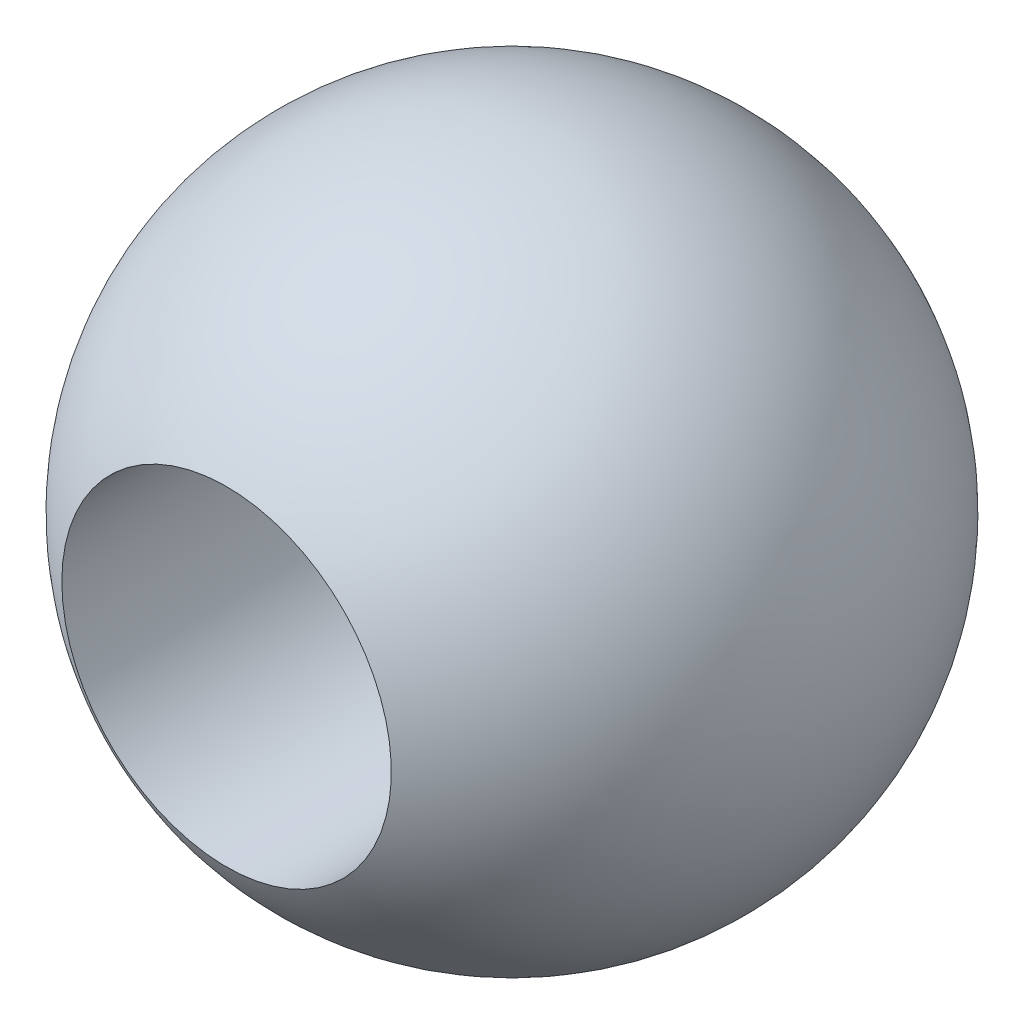
ISO-10303-21;
HEADER;
FILE_DESCRIPTION(('STEP AP214'),'2;1');
FILE_NAME('part.step','',(''),(''),'','','');
FILE_SCHEMA(('AUTOMOTIVE_DESIGN { 1 0 10303 214 1 1 1 1 }'));
ENDSEC;
DATA;
#1=APPLICATION_CONTEXT('core data for automotive mechanical design processes');
#2=APPLICATION_PROTOCOL_DEFINITION('international standard','automotive_design',2000,#1);
#3=PRODUCT_CONTEXT('',#1,'mechanical');
#4=PRODUCT('Part','Part','',(#3));
#5=PRODUCT_RELATED_PRODUCT_CATEGORY('part','',(#4));
#6=PRODUCT_DEFINITION_FORMATION('','',#4);
#7=PRODUCT_DEFINITION_CONTEXT('part definition',#1,'design');
#8=PRODUCT_DEFINITION('design','',#6,#7);
#9=PRODUCT_DEFINITION_SHAPE('','',#8);
#10=(LENGTH_UNIT() NAMED_UNIT(*) SI_UNIT(.MILLI.,.METRE.));
#11=(NAMED_UNIT(*) PLANE_ANGLE_UNIT() SI_UNIT($,.RADIAN.));
#12=(NAMED_UNIT(*) SI_UNIT($,.STERADIAN.) SOLID_ANGLE_UNIT());
#13=UNCERTAINTY_MEASURE_WITH_UNIT(LENGTH_MEASURE(1.E-05),#10,'distance_accuracy_value','');
#14=(GEOMETRIC_REPRESENTATION_CONTEXT(3) GLOBAL_UNCERTAINTY_ASSIGNED_CONTEXT((#13)) GLOBAL_UNIT_ASSIGNED_CONTEXT((#10,
#11,#12)) REPRESENTATION_CONTEXT('',''));
#15=CARTESIAN_POINT('',(0.,0.,0.));
#16=DIRECTION('',(0.,0.,1.));
#17=DIRECTION('',(1.,0.,0.));
#18=AXIS2_PLACEMENT_3D('',#15,#16,#17);
#19=CARTESIAN_POINT('',(0.,0.,0.));
#20=DIRECTION('',(0.,-1.,0.));
#21=DIRECTION('',(-1.,0.,0.));
#22=AXIS2_PLACEMENT_3D('',#19,#20,#21);
#23=SPHERICAL_SURFACE('',#22,3.175);
#24=CARTESIAN_POINT('',(0.,0.,0.));
#25=DIRECTION('',(0.,0.,-1.));
#26=DIRECTION('',(-1.,0.,0.));
#27=AXIS2_PLACEMENT_3D('',#24,#25,#26);
#28=SPHERICAL_SURFACE('',#27,3.175);
#29=CARTESIAN_POINT('',(0.,0.,2.74963065701559));
#30=DIRECTION('',(0.,0.,-1.));
#31=DIRECTION('',(-1.,0.,0.));
#32=AXIS2_PLACEMENT_3D('',#29,#30,#31);
#33=CIRCLE('',#32,1.5875);
#34=CARTESIAN_POINT('',(-1.5875,0.,2.74963065701559));
#35=VERTEX_POINT('',#34);
#36=EDGE_CURVE('E10',#35,#35,#33,.T.);
#37=ORIENTED_EDGE('',*,*,#36,.T.);
#38=EDGE_LOOP('',(#37));
#39=FACE_BOUND('',#38,.T.);
#40=CARTESIAN_POINT('',(0.,0.,-2.74963065701559));
#41=DIRECTION('',(0.,0.,1.));
#42=DIRECTION('',(1.,0.,0.));
#43=AXIS2_PLACEMENT_3D('',#40,#41,#42);
#44=CIRCLE('',#43,1.5875);
#45=CARTESIAN_POINT('',(1.5875,0.,-2.74963065701559));
#46=VERTEX_POINT('',#45);
#47=EDGE_CURVE('E36',#46,#46,#44,.T.);
#48=ORIENTED_EDGE('',*,*,#47,.T.);
#49=EDGE_LOOP('',(#48));
#50=FACE_BOUND('',#49,.T.);
#51=ADVANCED_FACE('F30',(#39,#50),#28,.T.);
#52=CARTESIAN_POINT('',(0.,0.,-3.175));
#53=DIRECTION('',(0.,0.,1.));
#54=DIRECTION('',(1.,0.,0.));
#55=AXIS2_PLACEMENT_3D('',#52,#53,#54);
#56=CYLINDRICAL_SURFACE('',#55,1.5875);
#57=ORIENTED_EDGE('',*,*,#36,.F.);
#58=EDGE_LOOP('',(#57));
#59=FACE_BOUND('',#58,.T.);
#60=ORIENTED_EDGE('',*,*,#47,.F.);
#61=EDGE_LOOP('',(#60));
#62=FACE_BOUND('',#61,.T.);
#63=ADVANCED_FACE('F43',(#59,#62),#56,.F.);
#64=CLOSED_SHELL('',(#51,#63));
#65=MANIFOLD_SOLID_BREP('B2',#64);
#66=ADVANCED_BREP_SHAPE_REPRESENTATION('',(#18,#65),#14);
#67=SHAPE_DEFINITION_REPRESENTATION(#9,#66);
ENDSEC;
END-ISO-10303-21;
